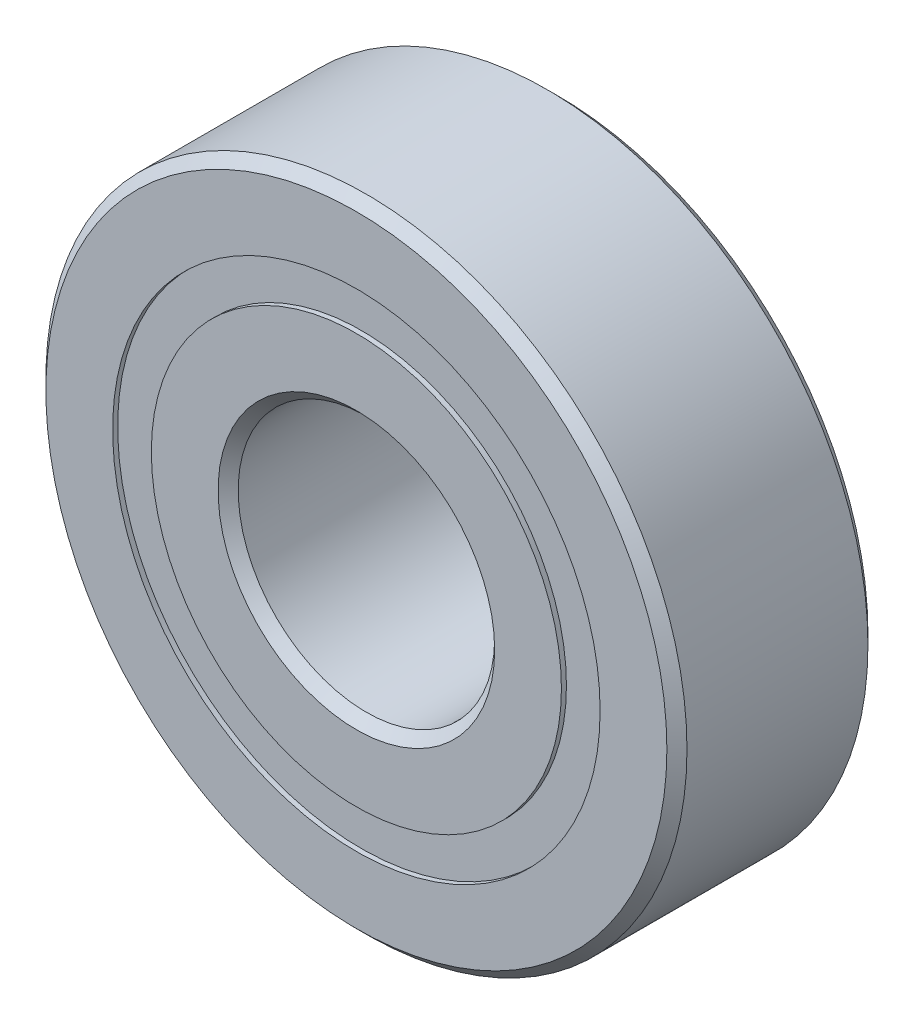
ISO-10303-21;
HEADER;
FILE_DESCRIPTION(('STEP AP214'),'2;1');
FILE_NAME('part.step','',(''),(''),'','','');
FILE_SCHEMA(('AUTOMOTIVE_DESIGN { 1 0 10303 214 1 1 1 1 }'));
ENDSEC;
DATA;
#1=APPLICATION_CONTEXT('core data for automotive mechanical design processes');
#2=APPLICATION_PROTOCOL_DEFINITION('international standard','automotive_design',2000,#1);
#3=PRODUCT_CONTEXT('',#1,'mechanical');
#4=PRODUCT('Part','Part','',(#3));
#5=PRODUCT_RELATED_PRODUCT_CATEGORY('part','',(#4));
#6=PRODUCT_DEFINITION_FORMATION('','',#4);
#7=PRODUCT_DEFINITION_CONTEXT('part definition',#1,'design');
#8=PRODUCT_DEFINITION('design','',#6,#7);
#9=PRODUCT_DEFINITION_SHAPE('','',#8);
#10=(LENGTH_UNIT() NAMED_UNIT(*) SI_UNIT(.MILLI.,.METRE.));
#11=(NAMED_UNIT(*) PLANE_ANGLE_UNIT() SI_UNIT($,.RADIAN.));
#12=(NAMED_UNIT(*) SI_UNIT($,.STERADIAN.) SOLID_ANGLE_UNIT());
#13=UNCERTAINTY_MEASURE_WITH_UNIT(LENGTH_MEASURE(1.E-05),#10,'distance_accuracy_value','');
#14=(GEOMETRIC_REPRESENTATION_CONTEXT(3) GLOBAL_UNCERTAINTY_ASSIGNED_CONTEXT((#13)) GLOBAL_UNIT_ASSIGNED_CONTEXT((#10,
#11,#12)) REPRESENTATION_CONTEXT('',''));
#15=CARTESIAN_POINT('',(0.,0.,0.));
#16=DIRECTION('',(0.,0.,1.));
#17=DIRECTION('',(1.,0.,0.));
#18=AXIS2_PLACEMENT_3D('',#15,#16,#17);
#19=CARTESIAN_POINT('',(0.,6.03522142857143,-2.36474));
#20=DIRECTION('',(0.,0.,1.));
#21=DIRECTION('',(1.,0.,0.));
#22=AXIS2_PLACEMENT_3D('',#19,#20,#21);
#23=PLANE('',#22);
#24=CARTESIAN_POINT('',(0.,0.,-2.36474));
#25=DIRECTION('',(0.,0.,1.));
#26=DIRECTION('',(1.,0.,0.));
#27=AXIS2_PLACEMENT_3D('',#24,#25,#26);
#28=CIRCLE('',#27,6.03522142857143);
#29=CARTESIAN_POINT('',(6.03522142857143,0.,-2.36474));
#30=VERTEX_POINT('',#29);
#31=EDGE_CURVE('E55',#30,#30,#28,.T.);
#32=ORIENTED_EDGE('',*,*,#31,.F.);
#33=EDGE_LOOP('',(#32));
#34=FACE_BOUND('',#33,.T.);
#35=CARTESIAN_POINT('',(0.,0.,-2.36474));
#36=DIRECTION('',(0.,0.,1.));
#37=DIRECTION('',(1.,0.,0.));
#38=AXIS2_PLACEMENT_3D('',#35,#36,#37);
#39=CIRCLE('',#38,5.07727857142857);
#40=CARTESIAN_POINT('',(5.07727857142857,0.,-2.36474));
#41=VERTEX_POINT('',#40);
#42=EDGE_CURVE('E11',#41,#41,#39,.T.);
#43=ORIENTED_EDGE('',*,*,#42,.T.);
#44=EDGE_LOOP('',(#43));
#45=FACE_BOUND('',#44,.T.);
#46=ADVANCED_FACE('F41',(#34,#45),#23,.F.);
#47=CARTESIAN_POINT('',(0.,0.,2.4892));
#48=DIRECTION('',(0.,0.,1.));
#49=DIRECTION('',(1.,0.,0.));
#50=AXIS2_PLACEMENT_3D('',#47,#48,#49);
#51=CYLINDRICAL_SURFACE('',#50,5.07727857142857);
#52=ORIENTED_EDGE('',*,*,#42,.F.);
#53=EDGE_LOOP('',(#52));
#54=FACE_BOUND('',#53,.T.);
#55=CARTESIAN_POINT('',(0.,0.,-1.20554465033679));
#56=DIRECTION('',(0.,0.,1.));
#57=DIRECTION('',(1.,0.,0.));
#58=AXIS2_PLACEMENT_3D('',#55,#56,#57);
#59=CIRCLE('',#58,5.07727857142857);
#60=CARTESIAN_POINT('',(5.07727857142857,0.,-1.20554465033679));
#61=VERTEX_POINT('',#60);
#62=EDGE_CURVE('E47',#61,#61,#59,.T.);
#63=ORIENTED_EDGE('',*,*,#62,.T.);
#64=EDGE_LOOP('',(#63));
#65=FACE_BOUND('',#64,.T.);
#66=ADVANCED_FACE('F64',(#54,#65),#51,.F.);
#67=CARTESIAN_POINT('',(0.,6.03522142857143,-1.20554465033679));
#68=DIRECTION('',(0.,0.,-1.));
#69=DIRECTION('',(-1.,0.,0.));
#70=AXIS2_PLACEMENT_3D('',#67,#68,#69);
#71=PLANE('',#70);
#72=ORIENTED_EDGE('',*,*,#62,.F.);
#73=EDGE_LOOP('',(#72));
#74=FACE_BOUND('',#73,.T.);
#75=CARTESIAN_POINT('',(0.,0.,-1.20554465033679));
#76=DIRECTION('',(0.,0.,1.));
#77=DIRECTION('',(1.,0.,0.));
#78=AXIS2_PLACEMENT_3D('',#75,#76,#77);
#79=CIRCLE('',#78,6.03522142857143);
#80=CARTESIAN_POINT('',(6.03522142857143,0.,-1.20554465033679));
#81=VERTEX_POINT('',#80);
#82=EDGE_CURVE('E51',#81,#81,#79,.T.);
#83=ORIENTED_EDGE('',*,*,#82,.T.);
#84=EDGE_LOOP('',(#83));
#85=FACE_BOUND('',#84,.T.);
#86=ADVANCED_FACE('F68',(#74,#85),#71,.F.);
#87=CARTESIAN_POINT('',(0.,0.,2.4892));
#88=DIRECTION('',(0.,0.,1.));
#89=DIRECTION('',(1.,0.,0.));
#90=AXIS2_PLACEMENT_3D('',#87,#88,#89);
#91=CYLINDRICAL_SURFACE('',#90,6.03522142857143);
#92=ORIENTED_EDGE('',*,*,#82,.F.);
#93=EDGE_LOOP('',(#92));
#94=FACE_BOUND('',#93,.T.);
#95=ORIENTED_EDGE('',*,*,#31,.T.);
#96=EDGE_LOOP('',(#95));
#97=FACE_BOUND('',#96,.T.);
#98=ADVANCED_FACE('F61',(#94,#97),#91,.T.);
#99=CLOSED_SHELL('',(#46,#66,#86,#98));
#100=MANIFOLD_SOLID_BREP('B2',#99);
#101=CARTESIAN_POINT('',(0.,6.03522142857143,2.36474));
#102=DIRECTION('',(0.,0.,-1.));
#103=DIRECTION('',(-1.,0.,0.));
#104=AXIS2_PLACEMENT_3D('',#101,#102,#103);
#105=PLANE('',#104);
#106=CARTESIAN_POINT('',(0.,0.,2.36474));
#107=DIRECTION('',(0.,0.,1.));
#108=DIRECTION('',(1.,0.,0.));
#109=AXIS2_PLACEMENT_3D('',#106,#107,#108);
#110=CIRCLE('',#109,5.07727857142857);
#111=CARTESIAN_POINT('',(5.07727857142857,0.,2.36474));
#112=VERTEX_POINT('',#111);
#113=EDGE_CURVE('E40',#112,#112,#110,.T.);
#114=ORIENTED_EDGE('',*,*,#113,.F.);
#115=EDGE_LOOP('',(#114));
#116=FACE_BOUND('',#115,.T.);
#117=CARTESIAN_POINT('',(0.,0.,2.36474));
#118=DIRECTION('',(0.,0.,1.));
#119=DIRECTION('',(1.,0.,0.));
#120=AXIS2_PLACEMENT_3D('',#117,#118,#119);
#121=CIRCLE('',#120,6.03522142857143);
#122=CARTESIAN_POINT('',(6.03522142857143,0.,2.36474));
#123=VERTEX_POINT('',#122);
#124=EDGE_CURVE('E122',#123,#123,#121,.T.);
#125=ORIENTED_EDGE('',*,*,#124,.T.);
#126=EDGE_LOOP('',(#125));
#127=FACE_BOUND('',#126,.T.);
#128=ADVANCED_FACE('F108',(#116,#127),#105,.F.);
#129=CARTESIAN_POINT('',(0.,0.,2.4892));
#130=DIRECTION('',(0.,0.,1.));
#131=DIRECTION('',(1.,0.,0.));
#132=AXIS2_PLACEMENT_3D('',#129,#130,#131);
#133=CYLINDRICAL_SURFACE('',#132,5.07727857142857);
#134=CARTESIAN_POINT('',(0.,0.,1.20554465033679));
#135=DIRECTION('',(0.,0.,1.));
#136=DIRECTION('',(1.,0.,0.));
#137=AXIS2_PLACEMENT_3D('',#134,#135,#136);
#138=CIRCLE('',#137,5.07727857142857);
#139=CARTESIAN_POINT('',(5.07727857142857,0.,1.20554465033679));
#140=VERTEX_POINT('',#139);
#141=EDGE_CURVE('E114',#140,#140,#138,.T.);
#142=ORIENTED_EDGE('',*,*,#141,.F.);
#143=EDGE_LOOP('',(#142));
#144=FACE_BOUND('',#143,.T.);
#145=ORIENTED_EDGE('',*,*,#113,.T.);
#146=EDGE_LOOP('',(#145));
#147=FACE_BOUND('',#146,.T.);
#148=ADVANCED_FACE('F137',(#144,#147),#133,.F.);
#149=CARTESIAN_POINT('',(0.,6.03522142857143,1.20554465033679));
#150=DIRECTION('',(0.,0.,1.));
#151=DIRECTION('',(1.,0.,0.));
#152=AXIS2_PLACEMENT_3D('',#149,#150,#151);
#153=PLANE('',#152);
#154=CARTESIAN_POINT('',(0.,0.,1.20554465033679));
#155=DIRECTION('',(0.,0.,1.));
#156=DIRECTION('',(1.,0.,0.));
#157=AXIS2_PLACEMENT_3D('',#154,#155,#156);
#158=CIRCLE('',#157,6.03522142857143);
#159=CARTESIAN_POINT('',(6.03522142857143,0.,1.20554465033679));
#160=VERTEX_POINT('',#159);
#161=EDGE_CURVE('E118',#160,#160,#158,.T.);
#162=ORIENTED_EDGE('',*,*,#161,.F.);
#163=EDGE_LOOP('',(#162));
#164=FACE_BOUND('',#163,.T.);
#165=ORIENTED_EDGE('',*,*,#141,.T.);
#166=EDGE_LOOP('',(#165));
#167=FACE_BOUND('',#166,.T.);
#168=ADVANCED_FACE('F132',(#164,#167),#153,.F.);
#169=CARTESIAN_POINT('',(0.,0.,2.4892));
#170=DIRECTION('',(0.,0.,1.));
#171=DIRECTION('',(1.,0.,0.));
#172=AXIS2_PLACEMENT_3D('',#169,#170,#171);
#173=CYLINDRICAL_SURFACE('',#172,6.03522142857143);
#174=ORIENTED_EDGE('',*,*,#124,.F.);
#175=EDGE_LOOP('',(#174));
#176=FACE_BOUND('',#175,.T.);
#177=ORIENTED_EDGE('',*,*,#161,.T.);
#178=EDGE_LOOP('',(#177));
#179=FACE_BOUND('',#178,.T.);
#180=ADVANCED_FACE('F129',(#176,#179),#173,.T.);
#181=CLOSED_SHELL('',(#128,#148,#168,#180));
#182=MANIFOLD_SOLID_BREP('B6',#181);
#183=CARTESIAN_POINT('',(-3.26588180805,4.49510067499584,0.));
#184=DIRECTION('',(0.,0.,1.));
#185=DIRECTION('',(-0.587785252292462,0.809016994374955,0.));
#186=AXIS2_PLACEMENT_3D('',#183,#184,#185);
#187=SPHERICAL_SURFACE('',#186,1.20554465033679);
#188=CARTESIAN_POINT('',(-3.26588180805,4.49510067499584,1.20554465033679));
#189=VERTEX_POINT('',#188);
#190=VERTEX_LOOP('',#189);
#191=FACE_BOUND('',#190,.T.);
#192=ADVANCED_FACE('F175',(#191),#187,.T.);
#193=CLOSED_SHELL('',(#192));
#194=MANIFOLD_SOLID_BREP('B35',#193);
#195=CARTESIAN_POINT('',(-5.28430776866493,1.71697567499586,0.));
#196=DIRECTION('',(0.,0.,1.));
#197=DIRECTION('',(-0.95105651629515,0.309016994374958,0.));
#198=AXIS2_PLACEMENT_3D('',#195,#196,#197);
#199=SPHERICAL_SURFACE('',#198,1.20554465033679);
#200=CARTESIAN_POINT('',(-5.28430776866493,1.71697567499586,1.20554465033679));
#201=VERTEX_POINT('',#200);
#202=VERTEX_LOOP('',#201);
#203=FACE_BOUND('',#202,.T.);
#204=ADVANCED_FACE('F195',(#203),#199,.T.);
#205=CLOSED_SHELL('',(#204));
#206=MANIFOLD_SOLID_BREP('B104',#205);
#207=CARTESIAN_POINT('',(-5.28430776866496,-1.71697567499575,0.));
#208=DIRECTION('',(0.,0.,1.));
#209=DIRECTION('',(-0.951056516295157,-0.309016994374938,0.));
#210=AXIS2_PLACEMENT_3D('',#207,#208,#209);
#211=SPHERICAL_SURFACE('',#210,1.20554465033679);
#212=CARTESIAN_POINT('',(-5.28430776866496,-1.71697567499575,1.20554465033679));
#213=VERTEX_POINT('',#212);
#214=VERTEX_LOOP('',#213);
#215=FACE_BOUND('',#214,.T.);
#216=ADVANCED_FACE('F215',(#215),#211,.T.);
#217=CLOSED_SHELL('',(#216));
#218=MANIFOLD_SOLID_BREP('B171',#217);
#219=CARTESIAN_POINT('',(-3.26588180805009,-4.49510067499577,0.));
#220=DIRECTION('',(0.,0.,1.));
#221=DIRECTION('',(-0.58778525229248,-0.809016994374942,0.));
#222=AXIS2_PLACEMENT_3D('',#219,#220,#221);
#223=SPHERICAL_SURFACE('',#222,1.20554465033679);
#224=CARTESIAN_POINT('',(-3.26588180805009,-4.49510067499577,1.20554465033679));
#225=VERTEX_POINT('',#224);
#226=VERTEX_LOOP('',#225);
#227=FACE_BOUND('',#226,.T.);
#228=ADVANCED_FACE('F235',(#227),#223,.T.);
#229=CLOSED_SHELL('',(#228));
#230=MANIFOLD_SOLID_BREP('B191',#229);
#231=CARTESIAN_POINT('',(0.,-5.55625,0.));
#232=DIRECTION('',(0.,0.,1.));
#233=DIRECTION('',(0.,-1.,0.));
#234=AXIS2_PLACEMENT_3D('',#231,#232,#233);
#235=SPHERICAL_SURFACE('',#234,1.20554465033679);
#236=CARTESIAN_POINT('',(0.,-5.55625,1.20554465033679));
#237=VERTEX_POINT('',#236);
#238=VERTEX_LOOP('',#237);
#239=FACE_BOUND('',#238,.T.);
#240=ADVANCED_FACE('F255',(#239),#235,.T.);
#241=CLOSED_SHELL('',(#240));
#242=MANIFOLD_SOLID_BREP('B211',#241);
#243=CARTESIAN_POINT('',(3.26588180805003,-4.49510067499582,0.));
#244=DIRECTION('',(0.,0.,1.));
#245=DIRECTION('',(0.587785252292469,-0.809016994374951,0.));
#246=AXIS2_PLACEMENT_3D('',#243,#244,#245);
#247=SPHERICAL_SURFACE('',#246,1.20554465033679);
#248=CARTESIAN_POINT('',(3.26588180805003,-4.49510067499582,1.20554465033679));
#249=VERTEX_POINT('',#248);
#250=VERTEX_LOOP('',#249);
#251=FACE_BOUND('',#250,.T.);
#252=ADVANCED_FACE('F275',(#251),#247,.T.);
#253=CLOSED_SHELL('',(#252));
#254=MANIFOLD_SOLID_BREP('B231',#253);
#255=CARTESIAN_POINT('',(5.28430776866494,-1.71697567499582,0.));
#256=DIRECTION('',(0.,0.,1.));
#257=DIRECTION('',(0.951056516295152,-0.309016994374952,0.));
#258=AXIS2_PLACEMENT_3D('',#255,#256,#257);
#259=SPHERICAL_SURFACE('',#258,1.20554465033679);
#260=CARTESIAN_POINT('',(5.28430776866494,-1.71697567499582,1.20554465033679));
#261=VERTEX_POINT('',#260);
#262=VERTEX_LOOP('',#261);
#263=FACE_BOUND('',#262,.T.);
#264=ADVANCED_FACE('F295',(#263),#259,.T.);
#265=CLOSED_SHELL('',(#264));
#266=MANIFOLD_SOLID_BREP('B251',#265);
#267=CARTESIAN_POINT('',(5.28430776866495,1.71697567499579,0.));
#268=DIRECTION('',(0.,0.,1.));
#269=DIRECTION('',(0.951056516295155,0.309016994374945,0.));
#270=AXIS2_PLACEMENT_3D('',#267,#268,#269);
#271=SPHERICAL_SURFACE('',#270,1.20554465033679);
#272=CARTESIAN_POINT('',(5.28430776866495,1.71697567499579,1.20554465033679));
#273=VERTEX_POINT('',#272);
#274=VERTEX_LOOP('',#273);
#275=FACE_BOUND('',#274,.T.);
#276=ADVANCED_FACE('F315',(#275),#271,.T.);
#277=CLOSED_SHELL('',(#276));
#278=MANIFOLD_SOLID_BREP('B271',#277);
#279=CARTESIAN_POINT('',(3.26588180805006,4.4951006749958,0.));
#280=DIRECTION('',(0.,0.,1.));
#281=DIRECTION('',(0.587785252292474,0.809016994374947,0.));
#282=AXIS2_PLACEMENT_3D('',#279,#280,#281);
#283=SPHERICAL_SURFACE('',#282,1.20554465033679);
#284=CARTESIAN_POINT('',(3.26588180805006,4.4951006749958,1.20554465033679));
#285=VERTEX_POINT('',#284);
#286=VERTEX_LOOP('',#285);
#287=FACE_BOUND('',#286,.T.);
#288=ADVANCED_FACE('F335',(#287),#283,.T.);
#289=CLOSED_SHELL('',(#288));
#290=MANIFOLD_SOLID_BREP('B291',#289);
#291=CARTESIAN_POINT('',(0.,5.55625,0.));
#292=DIRECTION('',(0.,0.,1.));
#293=DIRECTION('',(0.,1.,0.));
#294=AXIS2_PLACEMENT_3D('',#291,#292,#293);
#295=SPHERICAL_SURFACE('',#294,1.20554465033679);
#296=CARTESIAN_POINT('',(0.,5.55625,1.20554465033679));
#297=VERTEX_POINT('',#296);
#298=VERTEX_LOOP('',#297);
#299=FACE_BOUND('',#298,.T.);
#300=ADVANCED_FACE('F357',(#299),#295,.T.);
#301=CLOSED_SHELL('',(#300));
#302=MANIFOLD_SOLID_BREP('B311',#301);
#303=CARTESIAN_POINT('',(0.,5.07727857142857,2.4892));
#304=DIRECTION('',(0.,0.,-1.));
#305=DIRECTION('',(-1.,0.,0.));
#306=AXIS2_PLACEMENT_3D('',#303,#304,#305);
#307=PLANE('',#306);
#308=CARTESIAN_POINT('',(0.,0.,2.4892));
#309=DIRECTION('',(0.,0.,1.));
#310=DIRECTION('',(1.,0.,0.));
#311=AXIS2_PLACEMENT_3D('',#308,#309,#310);
#312=CIRCLE('',#311,3.42392);
#313=CARTESIAN_POINT('',(3.42392,0.,2.4892));
#314=VERTEX_POINT('',#313);
#315=EDGE_CURVE('E404',#314,#314,#312,.T.);
#316=ORIENTED_EDGE('',*,*,#315,.F.);
#317=EDGE_LOOP('',(#316));
#318=FACE_BOUND('',#317,.T.);
#319=CARTESIAN_POINT('',(0.,0.,2.4892));
#320=DIRECTION('',(0.,0.,1.));
#321=DIRECTION('',(1.,0.,0.));
#322=AXIS2_PLACEMENT_3D('',#319,#320,#321);
#323=CIRCLE('',#322,5.07727857142857);
#324=CARTESIAN_POINT('',(5.07727857142857,0.,2.4892));
#325=VERTEX_POINT('',#324);
#326=EDGE_CURVE('E356',#325,#325,#323,.T.);
#327=ORIENTED_EDGE('',*,*,#326,.T.);
#328=EDGE_LOOP('',(#327));
#329=FACE_BOUND('',#328,.T.);
#330=ADVANCED_FACE('F376',(#318,#329),#307,.F.);
#331=CARTESIAN_POINT('',(0.,0.,2.4892));
#332=DIRECTION('',(0.,0.,1.));
#333=DIRECTION('',(1.,0.,0.));
#334=AXIS2_PLACEMENT_3D('',#331,#332,#333);
#335=CYLINDRICAL_SURFACE('',#334,5.07727857142857);
#336=ORIENTED_EDGE('',*,*,#326,.F.);
#337=EDGE_LOOP('',(#336));
#338=FACE_BOUND('',#337,.T.);
#339=CARTESIAN_POINT('',(0.,0.,1.10631111111111));
#340=DIRECTION('',(0.,0.,1.));
#341=DIRECTION('',(1.,0.,0.));
#342=AXIS2_PLACEMENT_3D('',#339,#340,#341);
#343=CIRCLE('',#342,5.07727857142857);
#344=CARTESIAN_POINT('',(5.07727857142857,0.,1.10631111111111));
#345=VERTEX_POINT('',#344);
#346=EDGE_CURVE('E382',#345,#345,#343,.T.);
#347=ORIENTED_EDGE('',*,*,#346,.T.);
#348=EDGE_LOOP('',(#347));
#349=FACE_BOUND('',#348,.T.);
#350=ADVANCED_FACE('F411',(#338,#349),#335,.T.);
#351=CARTESIAN_POINT('',(0.,0.,0.));
#352=DIRECTION('',(0.,0.,1.));
#353=DIRECTION('',(1.,0.,0.));
#354=AXIS2_PLACEMENT_3D('',#351,#352,#353);
#355=TOROIDAL_SURFACE('',#354,5.55625,1.20554465033679);
#356=ORIENTED_EDGE('',*,*,#346,.F.);
#357=EDGE_LOOP('',(#356));
#358=FACE_BOUND('',#357,.T.);
#359=CARTESIAN_POINT('',(0.,0.,-1.10631111111111));
#360=DIRECTION('',(0.,0.,1.));
#361=DIRECTION('',(1.,0.,0.));
#362=AXIS2_PLACEMENT_3D('',#359,#360,#361);
#363=CIRCLE('',#362,5.07727857142857);
#364=CARTESIAN_POINT('',(5.07727857142857,0.,-1.10631111111111));
#365=VERTEX_POINT('',#364);
#366=EDGE_CURVE('E386',#365,#365,#363,.T.);
#367=ORIENTED_EDGE('',*,*,#366,.T.);
#368=EDGE_LOOP('',(#367));
#369=FACE_BOUND('',#368,.T.);
#370=ADVANCED_FACE('F415',(#358,#369),#355,.F.);
#371=CARTESIAN_POINT('',(0.,0.,2.4892));
#372=DIRECTION('',(0.,0.,1.));
#373=DIRECTION('',(1.,0.,0.));
#374=AXIS2_PLACEMENT_3D('',#371,#372,#373);
#375=CYLINDRICAL_SURFACE('',#374,5.07727857142857);
#376=ORIENTED_EDGE('',*,*,#366,.F.);
#377=EDGE_LOOP('',(#376));
#378=FACE_BOUND('',#377,.T.);
#379=CARTESIAN_POINT('',(0.,0.,-2.4892));
#380=DIRECTION('',(0.,0.,1.));
#381=DIRECTION('',(1.,0.,0.));
#382=AXIS2_PLACEMENT_3D('',#379,#380,#381);
#383=CIRCLE('',#382,5.07727857142857);
#384=CARTESIAN_POINT('',(5.07727857142857,0.,-2.4892));
#385=VERTEX_POINT('',#384);
#386=EDGE_CURVE('E390',#385,#385,#383,.T.);
#387=ORIENTED_EDGE('',*,*,#386,.T.);
#388=EDGE_LOOP('',(#387));
#389=FACE_BOUND('',#388,.T.);
#390=ADVANCED_FACE('F420',(#378,#389),#375,.T.);
#391=CARTESIAN_POINT('',(0.,3.42392,-2.4892));
#392=DIRECTION('',(0.,0.,1.));
#393=DIRECTION('',(1.,0.,0.));
#394=AXIS2_PLACEMENT_3D('',#391,#392,#393);
#395=PLANE('',#394);
#396=ORIENTED_EDGE('',*,*,#386,.F.);
#397=EDGE_LOOP('',(#396));
#398=FACE_BOUND('',#397,.T.);
#399=CARTESIAN_POINT('',(0.,0.,-2.4892));
#400=DIRECTION('',(0.,0.,1.));
#401=DIRECTION('',(1.,0.,0.));
#402=AXIS2_PLACEMENT_3D('',#399,#400,#401);
#403=CIRCLE('',#402,3.42392);
#404=CARTESIAN_POINT('',(3.42392,0.,-2.4892));
#405=VERTEX_POINT('',#404);
#406=EDGE_CURVE('E395',#405,#405,#403,.T.);
#407=ORIENTED_EDGE('',*,*,#406,.T.);
#408=EDGE_LOOP('',(#407));
#409=FACE_BOUND('',#408,.T.);
#410=ADVANCED_FACE('F426',(#398,#409),#395,.F.);
#411=CARTESIAN_POINT('',(0.,0.,-2.24028));
#412=DIRECTION('',(0.,0.,-1.));
#413=DIRECTION('',(-1.,0.,0.));
#414=AXIS2_PLACEMENT_3D('',#411,#412,#413);
#415=CONICAL_SURFACE('',#414,3.175,0.785398163397441);
#416=ORIENTED_EDGE('',*,*,#406,.F.);
#417=EDGE_LOOP('',(#416));
#418=FACE_BOUND('',#417,.T.);
#419=CARTESIAN_POINT('',(0.,0.,-2.24028));
#420=DIRECTION('',(0.,0.,1.));
#421=DIRECTION('',(1.,0.,0.));
#422=AXIS2_PLACEMENT_3D('',#419,#420,#421);
#423=CIRCLE('',#422,3.175);
#424=CARTESIAN_POINT('',(3.175,0.,-2.24028));
#425=VERTEX_POINT('',#424);
#426=EDGE_CURVE('E398',#425,#425,#423,.T.);
#427=ORIENTED_EDGE('',*,*,#426,.T.);
#428=EDGE_LOOP('',(#427));
#429=FACE_BOUND('',#428,.T.);
#430=ADVANCED_FACE('F430',(#418,#429),#415,.F.);
#431=CARTESIAN_POINT('',(0.,0.,2.4892));
#432=DIRECTION('',(0.,0.,1.));
#433=DIRECTION('',(1.,0.,0.));
#434=AXIS2_PLACEMENT_3D('',#431,#432,#433);
#435=CYLINDRICAL_SURFACE('',#434,3.175);
#436=ORIENTED_EDGE('',*,*,#426,.F.);
#437=EDGE_LOOP('',(#436));
#438=FACE_BOUND('',#437,.T.);
#439=CARTESIAN_POINT('',(0.,0.,2.24028));
#440=DIRECTION('',(0.,0.,1.));
#441=DIRECTION('',(1.,0.,0.));
#442=AXIS2_PLACEMENT_3D('',#439,#440,#441);
#443=CIRCLE('',#442,3.175);
#444=CARTESIAN_POINT('',(3.175,0.,2.24028));
#445=VERTEX_POINT('',#444);
#446=EDGE_CURVE('E401',#445,#445,#443,.T.);
#447=ORIENTED_EDGE('',*,*,#446,.T.);
#448=EDGE_LOOP('',(#447));
#449=FACE_BOUND('',#448,.T.);
#450=ADVANCED_FACE('F434',(#438,#449),#435,.F.);
#451=CARTESIAN_POINT('',(0.,0.,2.4892));
#452=DIRECTION('',(0.,0.,1.));
#453=DIRECTION('',(1.,0.,0.));
#454=AXIS2_PLACEMENT_3D('',#451,#452,#453);
#455=CONICAL_SURFACE('',#454,3.42392,0.785398163397457);
#456=ORIENTED_EDGE('',*,*,#446,.F.);
#457=EDGE_LOOP('',(#456));
#458=FACE_BOUND('',#457,.T.);
#459=ORIENTED_EDGE('',*,*,#315,.T.);
#460=EDGE_LOOP('',(#459));
#461=FACE_BOUND('',#460,.T.);
#462=ADVANCED_FACE('F408',(#458,#461),#455,.F.);
#463=CLOSED_SHELL('',(#330,#350,#370,#390,#410,#430,#450,#462));
#464=MANIFOLD_SOLID_BREP('B331',#463);
#465=CARTESIAN_POINT('',(0.,0.,2.24028));
#466=DIRECTION('',(0.,0.,-1.));
#467=DIRECTION('',(-1.,0.,0.));
#468=AXIS2_PLACEMENT_3D('',#465,#466,#467);
#469=CONICAL_SURFACE('',#468,7.9375,0.785398163397447);
#470=CARTESIAN_POINT('',(0.,0.,2.4892));
#471=DIRECTION('',(0.,0.,1.));
#472=DIRECTION('',(1.,0.,0.));
#473=AXIS2_PLACEMENT_3D('',#470,#471,#472);
#474=CIRCLE('',#473,7.68858);
#475=CARTESIAN_POINT('',(7.68858,0.,2.4892));
#476=VERTEX_POINT('',#475);
#477=EDGE_CURVE('E525',#476,#476,#474,.T.);
#478=ORIENTED_EDGE('',*,*,#477,.F.);
#479=EDGE_LOOP('',(#478));
#480=FACE_BOUND('',#479,.T.);
#481=CARTESIAN_POINT('',(0.,0.,2.24028));
#482=DIRECTION('',(0.,0.,1.));
#483=DIRECTION('',(1.,0.,0.));
#484=AXIS2_PLACEMENT_3D('',#481,#482,#483);
#485=CIRCLE('',#484,7.9375);
#486=CARTESIAN_POINT('',(7.9375,0.,2.24028));
#487=VERTEX_POINT('',#486);
#488=EDGE_CURVE('E375',#487,#487,#485,.T.);
#489=ORIENTED_EDGE('',*,*,#488,.T.);
#490=EDGE_LOOP('',(#489));
#491=FACE_BOUND('',#490,.T.);
#492=ADVANCED_FACE('F497',(#480,#491),#469,.T.);
#493=CARTESIAN_POINT('',(0.,0.,2.4892));
#494=DIRECTION('',(0.,0.,1.));
#495=DIRECTION('',(1.,0.,0.));
#496=AXIS2_PLACEMENT_3D('',#493,#494,#495);
#497=CYLINDRICAL_SURFACE('',#496,7.9375);
#498=ORIENTED_EDGE('',*,*,#488,.F.);
#499=EDGE_LOOP('',(#498));
#500=FACE_BOUND('',#499,.T.);
#501=CARTESIAN_POINT('',(0.,0.,-2.24028));
#502=DIRECTION('',(0.,0.,1.));
#503=DIRECTION('',(1.,0.,0.));
#504=AXIS2_PLACEMENT_3D('',#501,#502,#503);
#505=CIRCLE('',#504,7.9375);
#506=CARTESIAN_POINT('',(7.9375,0.,-2.24028));
#507=VERTEX_POINT('',#506);
#508=EDGE_CURVE('E503',#507,#507,#505,.T.);
#509=ORIENTED_EDGE('',*,*,#508,.T.);
#510=EDGE_LOOP('',(#509));
#511=FACE_BOUND('',#510,.T.);
#512=ADVANCED_FACE('F532',(#500,#511),#497,.T.);
#513=CARTESIAN_POINT('',(0.,0.,-2.4892));
#514=DIRECTION('',(0.,0.,1.));
#515=DIRECTION('',(1.,0.,0.));
#516=AXIS2_PLACEMENT_3D('',#513,#514,#515);
#517=CONICAL_SURFACE('',#516,7.68858,0.785398163397445);
#518=ORIENTED_EDGE('',*,*,#508,.F.);
#519=EDGE_LOOP('',(#518));
#520=FACE_BOUND('',#519,.T.);
#521=CARTESIAN_POINT('',(0.,0.,-2.4892));
#522=DIRECTION('',(0.,0.,1.));
#523=DIRECTION('',(1.,0.,0.));
#524=AXIS2_PLACEMENT_3D('',#521,#522,#523);
#525=CIRCLE('',#524,7.68858);
#526=CARTESIAN_POINT('',(7.68858,0.,-2.4892));
#527=VERTEX_POINT('',#526);
#528=EDGE_CURVE('E507',#527,#527,#525,.T.);
#529=ORIENTED_EDGE('',*,*,#528,.T.);
#530=EDGE_LOOP('',(#529));
#531=FACE_BOUND('',#530,.T.);
#532=ADVANCED_FACE('F536',(#520,#531),#517,.T.);
#533=CARTESIAN_POINT('',(0.,7.68858,-2.4892));
#534=DIRECTION('',(0.,0.,1.));
#535=DIRECTION('',(1.,0.,0.));
#536=AXIS2_PLACEMENT_3D('',#533,#534,#535);
#537=PLANE('',#536);
#538=ORIENTED_EDGE('',*,*,#528,.F.);
#539=EDGE_LOOP('',(#538));
#540=FACE_BOUND('',#539,.T.);
#541=CARTESIAN_POINT('',(0.,0.,-2.4892));
#542=DIRECTION('',(0.,0.,1.));
#543=DIRECTION('',(1.,0.,0.));
#544=AXIS2_PLACEMENT_3D('',#541,#542,#543);
#545=CIRCLE('',#544,6.03522142857143);
#546=CARTESIAN_POINT('',(6.03522142857143,0.,-2.4892));
#547=VERTEX_POINT('',#546);
#548=EDGE_CURVE('E511',#547,#547,#545,.T.);
#549=ORIENTED_EDGE('',*,*,#548,.T.);
#550=EDGE_LOOP('',(#549));
#551=FACE_BOUND('',#550,.T.);
#552=ADVANCED_FACE('F541',(#540,#551),#537,.F.);
#553=CARTESIAN_POINT('',(0.,0.,2.4892));
#554=DIRECTION('',(0.,0.,1.));
#555=DIRECTION('',(1.,0.,0.));
#556=AXIS2_PLACEMENT_3D('',#553,#554,#555);
#557=CYLINDRICAL_SURFACE('',#556,6.03522142857143);
#558=ORIENTED_EDGE('',*,*,#548,.F.);
#559=EDGE_LOOP('',(#558));
#560=FACE_BOUND('',#559,.T.);
#561=CARTESIAN_POINT('',(0.,0.,-1.10631111111111));
#562=DIRECTION('',(0.,0.,1.));
#563=DIRECTION('',(1.,0.,0.));
#564=AXIS2_PLACEMENT_3D('',#561,#562,#563);
#565=CIRCLE('',#564,6.03522142857143);
#566=CARTESIAN_POINT('',(6.03522142857143,0.,-1.10631111111111));
#567=VERTEX_POINT('',#566);
#568=EDGE_CURVE('E516',#567,#567,#565,.T.);
#569=ORIENTED_EDGE('',*,*,#568,.T.);
#570=EDGE_LOOP('',(#569));
#571=FACE_BOUND('',#570,.T.);
#572=ADVANCED_FACE('F547',(#560,#571),#557,.F.);
#573=CARTESIAN_POINT('',(0.,0.,0.));
#574=DIRECTION('',(0.,0.,1.));
#575=DIRECTION('',(1.,0.,0.));
#576=AXIS2_PLACEMENT_3D('',#573,#574,#575);
#577=TOROIDAL_SURFACE('',#576,5.55625,1.20554465033679);
#578=ORIENTED_EDGE('',*,*,#568,.F.);
#579=EDGE_LOOP('',(#578));
#580=FACE_BOUND('',#579,.T.);
#581=CARTESIAN_POINT('',(0.,0.,1.10631111111111));
#582=DIRECTION('',(0.,0.,1.));
#583=DIRECTION('',(1.,0.,0.));
#584=AXIS2_PLACEMENT_3D('',#581,#582,#583);
#585=CIRCLE('',#584,6.03522142857143);
#586=CARTESIAN_POINT('',(6.03522142857143,0.,1.10631111111111));
#587=VERTEX_POINT('',#586);
#588=EDGE_CURVE('E519',#587,#587,#585,.T.);
#589=ORIENTED_EDGE('',*,*,#588,.T.);
#590=EDGE_LOOP('',(#589));
#591=FACE_BOUND('',#590,.T.);
#592=ADVANCED_FACE('F551',(#580,#591),#577,.F.);
#593=CARTESIAN_POINT('',(0.,0.,2.4892));
#594=DIRECTION('',(0.,0.,1.));
#595=DIRECTION('',(1.,0.,0.));
#596=AXIS2_PLACEMENT_3D('',#593,#594,#595);
#597=CYLINDRICAL_SURFACE('',#596,6.03522142857143);
#598=ORIENTED_EDGE('',*,*,#588,.F.);
#599=EDGE_LOOP('',(#598));
#600=FACE_BOUND('',#599,.T.);
#601=CARTESIAN_POINT('',(0.,0.,2.4892));
#602=DIRECTION('',(0.,0.,1.));
#603=DIRECTION('',(1.,0.,0.));
#604=AXIS2_PLACEMENT_3D('',#601,#602,#603);
#605=CIRCLE('',#604,6.03522142857143);
#606=CARTESIAN_POINT('',(6.03522142857143,0.,2.4892));
#607=VERTEX_POINT('',#606);
#608=EDGE_CURVE('E522',#607,#607,#605,.T.);
#609=ORIENTED_EDGE('',*,*,#608,.T.);
#610=EDGE_LOOP('',(#609));
#611=FACE_BOUND('',#610,.T.);
#612=ADVANCED_FACE('F555',(#600,#611),#597,.F.);
#613=CARTESIAN_POINT('',(0.,7.68858,2.4892));
#614=DIRECTION('',(0.,0.,-1.));
#615=DIRECTION('',(-1.,0.,0.));
#616=AXIS2_PLACEMENT_3D('',#613,#614,#615);
#617=PLANE('',#616);
#618=ORIENTED_EDGE('',*,*,#608,.F.);
#619=EDGE_LOOP('',(#618));
#620=FACE_BOUND('',#619,.T.);
#621=ORIENTED_EDGE('',*,*,#477,.T.);
#622=EDGE_LOOP('',(#621));
#623=FACE_BOUND('',#622,.T.);
#624=ADVANCED_FACE('F529',(#620,#623),#617,.F.);
#625=CLOSED_SHELL('',(#492,#512,#532,#552,#572,#592,#612,#624));
#626=MANIFOLD_SOLID_BREP('B351',#625);
#627=ADVANCED_BREP_SHAPE_REPRESENTATION('',(#18,#100,#182,#194,#206,#218,#230,#242,#254,#266,
#278,#290,#302,#464,#626),#14);
#628=SHAPE_DEFINITION_REPRESENTATION(#9,#627);
ENDSEC;
END-ISO-10303-21;
